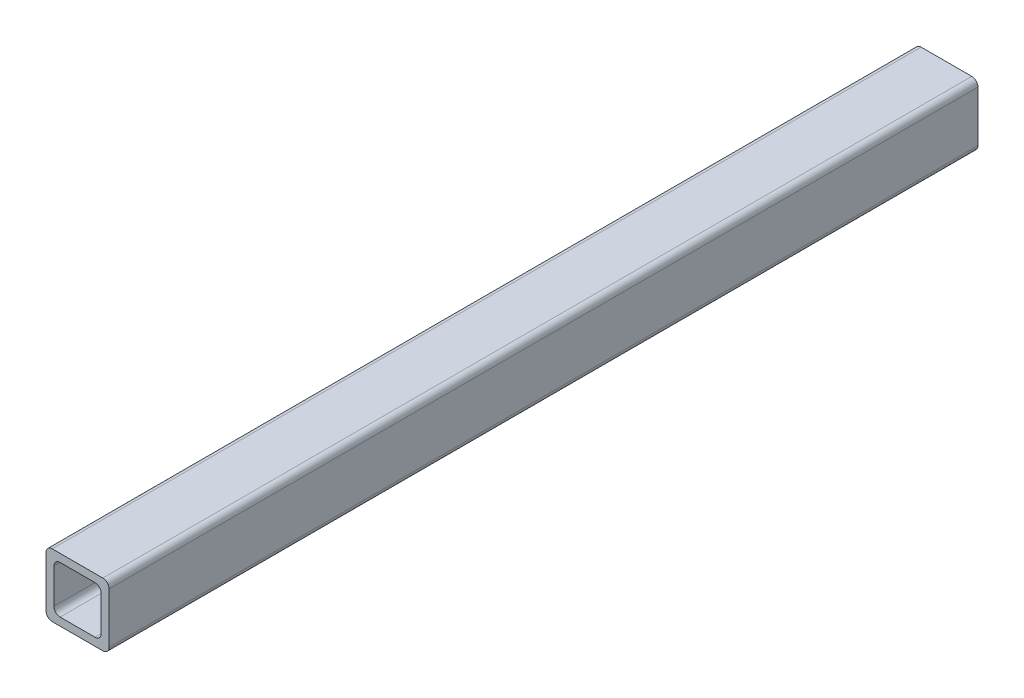
ISO-10303-21;
HEADER;
FILE_DESCRIPTION(('STEP AP214'),'2;1');
FILE_NAME('part.step','',(''),(''),'','','');
FILE_SCHEMA(('AUTOMOTIVE_DESIGN { 1 0 10303 214 1 1 1 1 }'));
ENDSEC;
DATA;
#1=APPLICATION_CONTEXT('core data for automotive mechanical design processes');
#2=APPLICATION_PROTOCOL_DEFINITION('international standard','automotive_design',2000,#1);
#3=PRODUCT_CONTEXT('',#1,'mechanical');
#4=PRODUCT('Part','Part','',(#3));
#5=PRODUCT_RELATED_PRODUCT_CATEGORY('part','',(#4));
#6=PRODUCT_DEFINITION_FORMATION('','',#4);
#7=PRODUCT_DEFINITION_CONTEXT('part definition',#1,'design');
#8=PRODUCT_DEFINITION('design','',#6,#7);
#9=PRODUCT_DEFINITION_SHAPE('','',#8);
#10=(LENGTH_UNIT() NAMED_UNIT(*) SI_UNIT(.MILLI.,.METRE.));
#11=(NAMED_UNIT(*) PLANE_ANGLE_UNIT() SI_UNIT($,.RADIAN.));
#12=(NAMED_UNIT(*) SI_UNIT($,.STERADIAN.) SOLID_ANGLE_UNIT());
#13=UNCERTAINTY_MEASURE_WITH_UNIT(LENGTH_MEASURE(1.E-05),#10,'distance_accuracy_value','');
#14=(GEOMETRIC_REPRESENTATION_CONTEXT(3) GLOBAL_UNCERTAINTY_ASSIGNED_CONTEXT((#13)) GLOBAL_UNIT_ASSIGNED_CONTEXT((#10,
#11,#12)) REPRESENTATION_CONTEXT('',''));
#15=CARTESIAN_POINT('',(0.,0.,0.));
#16=DIRECTION('',(0.,0.,1.));
#17=DIRECTION('',(1.,0.,0.));
#18=AXIS2_PLACEMENT_3D('',#15,#16,#17);
#19=CARTESIAN_POINT('',(10.2,-10.2,350.));
#20=DIRECTION('',(0.,0.,-1.));
#21=DIRECTION('',(-1.,0.,0.));
#22=AXIS2_PLACEMENT_3D('',#19,#20,#21);
#23=PLANE('',#22);
#24=CARTESIAN_POINT('',(10.2,-10.2,350.));
#25=DIRECTION('',(0.,0.,1.));
#26=DIRECTION('',(-1.,0.,0.));
#27=AXIS2_PLACEMENT_3D('',#24,#25,#26);
#28=CIRCLE('',#27,2.5);
#29=CARTESIAN_POINT('',(10.2,-12.7,350.));
#30=VERTEX_POINT('',#29);
#31=CARTESIAN_POINT('',(12.7,-10.2,350.));
#32=VERTEX_POINT('',#31);
#33=EDGE_CURVE('E217',#30,#32,#28,.T.);
#34=ORIENTED_EDGE('',*,*,#33,.T.);
#35=DIRECTION('',(0.,1.,0.));
#36=VECTOR('',#35,1.);
#37=CARTESIAN_POINT('',(12.7,-10.2,350.));
#38=LINE('',#37,#36);
#39=CARTESIAN_POINT('',(12.7,10.2,350.));
#40=VERTEX_POINT('',#39);
#41=EDGE_CURVE('E220',#32,#40,#38,.T.);
#42=ORIENTED_EDGE('',*,*,#41,.T.);
#43=CARTESIAN_POINT('',(10.2,10.2,350.));
#44=DIRECTION('',(0.,0.,1.));
#45=DIRECTION('',(1.,0.,0.));
#46=AXIS2_PLACEMENT_3D('',#43,#44,#45);
#47=CIRCLE('',#46,2.5);
#48=CARTESIAN_POINT('',(10.2,12.7,350.));
#49=VERTEX_POINT('',#48);
#50=EDGE_CURVE('E223',#40,#49,#47,.T.);
#51=ORIENTED_EDGE('',*,*,#50,.T.);
#52=DIRECTION('',(-1.,0.,0.));
#53=VECTOR('',#52,1.);
#54=CARTESIAN_POINT('',(-10.2,12.7,350.));
#55=LINE('',#54,#53);
#56=CARTESIAN_POINT('',(-10.2,12.7,350.));
#57=VERTEX_POINT('',#56);
#58=EDGE_CURVE('E225',#49,#57,#55,.T.);
#59=ORIENTED_EDGE('',*,*,#58,.T.);
#60=CARTESIAN_POINT('',(-10.2,10.2,350.));
#61=DIRECTION('',(0.,0.,1.));
#62=DIRECTION('',(1.,0.,0.));
#63=AXIS2_PLACEMENT_3D('',#60,#61,#62);
#64=CIRCLE('',#63,2.5);
#65=CARTESIAN_POINT('',(-12.7,10.2,350.));
#66=VERTEX_POINT('',#65);
#67=EDGE_CURVE('E227',#57,#66,#64,.T.);
#68=ORIENTED_EDGE('',*,*,#67,.T.);
#69=DIRECTION('',(0.,-1.,0.));
#70=VECTOR('',#69,1.);
#71=CARTESIAN_POINT('',(-12.7,-10.2,350.));
#72=LINE('',#71,#70);
#73=CARTESIAN_POINT('',(-12.7,-10.2,350.));
#74=VERTEX_POINT('',#73);
#75=EDGE_CURVE('E229',#66,#74,#72,.T.);
#76=ORIENTED_EDGE('',*,*,#75,.T.);
#77=CARTESIAN_POINT('',(-10.2,-10.2,350.));
#78=DIRECTION('',(0.,0.,1.));
#79=DIRECTION('',(-1.,0.,0.));
#80=AXIS2_PLACEMENT_3D('',#77,#78,#79);
#81=CIRCLE('',#80,2.5);
#82=CARTESIAN_POINT('',(-10.2,-12.7,350.));
#83=VERTEX_POINT('',#82);
#84=EDGE_CURVE('E231',#74,#83,#81,.T.);
#85=ORIENTED_EDGE('',*,*,#84,.T.);
#86=DIRECTION('',(1.,0.,0.));
#87=VECTOR('',#86,1.);
#88=CARTESIAN_POINT('',(-10.2,-12.7,350.));
#89=LINE('',#88,#87);
#90=EDGE_CURVE('E233',#83,#30,#89,.T.);
#91=ORIENTED_EDGE('',*,*,#90,.T.);
#92=EDGE_LOOP('',(#34,#42,#51,#59,#68,#76,#85,#91));
#93=FACE_BOUND('',#92,.T.);
#94=CARTESIAN_POINT('',(-7.02500000000001,-7.02499999999998,350.));
#95=DIRECTION('',(0.,0.,1.));
#96=DIRECTION('',(-1.,0.,0.));
#97=AXIS2_PLACEMENT_3D('',#94,#95,#96);
#98=CIRCLE('',#97,2.5);
#99=CARTESIAN_POINT('',(-9.52500000000001,-7.02499999999998,350.));
#100=VERTEX_POINT('',#99);
#101=CARTESIAN_POINT('',(-7.02500000000001,-9.52499999999998,350.));
#102=VERTEX_POINT('',#101);
#103=EDGE_CURVE('E152',#100,#102,#98,.T.);
#104=ORIENTED_EDGE('',*,*,#103,.F.);
#105=DIRECTION('',(0.,-1.,0.));
#106=VECTOR('',#105,1.);
#107=CARTESIAN_POINT('',(-9.52500000000001,-7.02499999999998,350.));
#108=LINE('',#107,#106);
#109=CARTESIAN_POINT('',(-9.52500000000001,7.025,350.));
#110=VERTEX_POINT('',#109);
#111=EDGE_CURVE('E185',#110,#100,#108,.T.);
#112=ORIENTED_EDGE('',*,*,#111,.F.);
#113=CARTESIAN_POINT('',(-7.025,7.025,350.));
#114=DIRECTION('',(0.,0.,1.));
#115=DIRECTION('',(-1.,0.,0.));
#116=AXIS2_PLACEMENT_3D('',#113,#114,#115);
#117=CIRCLE('',#116,2.5);
#118=CARTESIAN_POINT('',(-7.025,9.52500000000001,350.));
#119=VERTEX_POINT('',#118);
#120=EDGE_CURVE('E183',#119,#110,#117,.T.);
#121=ORIENTED_EDGE('',*,*,#120,.F.);
#122=DIRECTION('',(-1.,0.,0.));
#123=VECTOR('',#122,1.);
#124=CARTESIAN_POINT('',(-7.025,9.52500000000001,350.));
#125=LINE('',#124,#123);
#126=CARTESIAN_POINT('',(7.02499999999999,9.52500000000001,350.));
#127=VERTEX_POINT('',#126);
#128=EDGE_CURVE('E181',#127,#119,#125,.T.);
#129=ORIENTED_EDGE('',*,*,#128,.F.);
#130=CARTESIAN_POINT('',(7.02499999999999,7.025,350.));
#131=DIRECTION('',(0.,0.,1.));
#132=DIRECTION('',(1.,0.,0.));
#133=AXIS2_PLACEMENT_3D('',#130,#131,#132);
#134=CIRCLE('',#133,2.5);
#135=CARTESIAN_POINT('',(9.52499999999999,7.025,350.));
#136=VERTEX_POINT('',#135);
#137=EDGE_CURVE('E179',#136,#127,#134,.T.);
#138=ORIENTED_EDGE('',*,*,#137,.F.);
#139=DIRECTION('',(0.,1.,0.));
#140=VECTOR('',#139,1.);
#141=CARTESIAN_POINT('',(9.52499999999999,-7.02499999999998,350.));
#142=LINE('',#141,#140);
#143=CARTESIAN_POINT('',(9.52499999999999,-7.02499999999998,350.));
#144=VERTEX_POINT('',#143);
#145=EDGE_CURVE('E175',#144,#136,#142,.T.);
#146=ORIENTED_EDGE('',*,*,#145,.F.);
#147=CARTESIAN_POINT('',(7.02499999999999,-7.02499999999998,350.));
#148=DIRECTION('',(0.,0.,1.));
#149=DIRECTION('',(1.,0.,0.));
#150=AXIS2_PLACEMENT_3D('',#147,#148,#149);
#151=CIRCLE('',#150,2.5);
#152=CARTESIAN_POINT('',(7.02499999999999,-9.52499999999998,350.));
#153=VERTEX_POINT('',#152);
#154=EDGE_CURVE('E173',#153,#144,#151,.T.);
#155=ORIENTED_EDGE('',*,*,#154,.F.);
#156=DIRECTION('',(1.,0.,0.));
#157=VECTOR('',#156,1.);
#158=CARTESIAN_POINT('',(-7.02500000000001,-9.52499999999998,350.));
#159=LINE('',#158,#157);
#160=EDGE_CURVE('E160',#102,#153,#159,.T.);
#161=ORIENTED_EDGE('',*,*,#160,.F.);
#162=EDGE_LOOP('',(#104,#112,#121,#129,#138,#146,#155,#161));
#163=FACE_BOUND('',#162,.T.);
#164=ADVANCED_FACE('F39',(#93,#163),#23,.F.);
#165=CARTESIAN_POINT('',(10.2,-10.2,0.));
#166=DIRECTION('',(0.,0.,-1.));
#167=DIRECTION('',(-1.,0.,0.));
#168=AXIS2_PLACEMENT_3D('',#165,#166,#167);
#169=PLANE('',#168);
#170=CARTESIAN_POINT('',(10.2,-10.2,0.));
#171=DIRECTION('',(0.,0.,1.));
#172=DIRECTION('',(-1.,0.,0.));
#173=AXIS2_PLACEMENT_3D('',#170,#171,#172);
#174=CIRCLE('',#173,2.5);
#175=CARTESIAN_POINT('',(10.2,-12.7,0.));
#176=VERTEX_POINT('',#175);
#177=CARTESIAN_POINT('',(12.7,-10.2,0.));
#178=VERTEX_POINT('',#177);
#179=EDGE_CURVE('E168',#176,#178,#174,.T.);
#180=ORIENTED_EDGE('',*,*,#179,.F.);
#181=DIRECTION('',(1.,0.,0.));
#182=VECTOR('',#181,1.);
#183=CARTESIAN_POINT('',(-10.2,-12.7,0.));
#184=LINE('',#183,#182);
#185=CARTESIAN_POINT('',(-10.2,-12.7,0.));
#186=VERTEX_POINT('',#185);
#187=EDGE_CURVE('E221',#186,#176,#184,.T.);
#188=ORIENTED_EDGE('',*,*,#187,.F.);
#189=CARTESIAN_POINT('',(-10.2,-10.2,0.));
#190=DIRECTION('',(0.,0.,1.));
#191=DIRECTION('',(-1.,0.,0.));
#192=AXIS2_PLACEMENT_3D('',#189,#190,#191);
#193=CIRCLE('',#192,2.5);
#194=CARTESIAN_POINT('',(-12.7,-10.2,0.));
#195=VERTEX_POINT('',#194);
#196=EDGE_CURVE('E248',#195,#186,#193,.T.);
#197=ORIENTED_EDGE('',*,*,#196,.F.);
#198=DIRECTION('',(0.,-1.,0.));
#199=VECTOR('',#198,1.);
#200=CARTESIAN_POINT('',(-12.7,-10.2,0.));
#201=LINE('',#200,#199);
#202=CARTESIAN_POINT('',(-12.7,10.2,0.));
#203=VERTEX_POINT('',#202);
#204=EDGE_CURVE('E246',#203,#195,#201,.T.);
#205=ORIENTED_EDGE('',*,*,#204,.F.);
#206=CARTESIAN_POINT('',(-10.2,10.2,0.));
#207=DIRECTION('',(0.,0.,1.));
#208=DIRECTION('',(1.,0.,0.));
#209=AXIS2_PLACEMENT_3D('',#206,#207,#208);
#210=CIRCLE('',#209,2.5);
#211=CARTESIAN_POINT('',(-10.2,12.7,0.));
#212=VERTEX_POINT('',#211);
#213=EDGE_CURVE('E244',#212,#203,#210,.T.);
#214=ORIENTED_EDGE('',*,*,#213,.F.);
#215=DIRECTION('',(-1.,0.,0.));
#216=VECTOR('',#215,1.);
#217=CARTESIAN_POINT('',(-10.2,12.7,0.));
#218=LINE('',#217,#216);
#219=CARTESIAN_POINT('',(10.2,12.7,0.));
#220=VERTEX_POINT('',#219);
#221=EDGE_CURVE('E242',#220,#212,#218,.T.);
#222=ORIENTED_EDGE('',*,*,#221,.F.);
#223=CARTESIAN_POINT('',(10.2,10.2,0.));
#224=DIRECTION('',(0.,0.,1.));
#225=DIRECTION('',(1.,0.,0.));
#226=AXIS2_PLACEMENT_3D('',#223,#224,#225);
#227=CIRCLE('',#226,2.5);
#228=CARTESIAN_POINT('',(12.7,10.2,0.));
#229=VERTEX_POINT('',#228);
#230=EDGE_CURVE('E240',#229,#220,#227,.T.);
#231=ORIENTED_EDGE('',*,*,#230,.F.);
#232=DIRECTION('',(0.,1.,0.));
#233=VECTOR('',#232,1.);
#234=CARTESIAN_POINT('',(12.7,-10.2,0.));
#235=LINE('',#234,#233);
#236=EDGE_CURVE('E238',#178,#229,#235,.T.);
#237=ORIENTED_EDGE('',*,*,#236,.F.);
#238=EDGE_LOOP('',(#180,#188,#197,#205,#214,#222,#231,#237));
#239=FACE_BOUND('',#238,.T.);
#240=DIRECTION('',(0.,-1.,0.));
#241=VECTOR('',#240,1.);
#242=CARTESIAN_POINT('',(-9.52500000000001,-7.02499999999998,0.));
#243=LINE('',#242,#241);
#244=CARTESIAN_POINT('',(-9.52500000000001,7.02500000000001,0.));
#245=VERTEX_POINT('',#244);
#246=CARTESIAN_POINT('',(-9.52500000000001,-7.02499999999998,0.));
#247=VERTEX_POINT('',#246);
#248=EDGE_CURVE('E161',#245,#247,#243,.T.);
#249=ORIENTED_EDGE('',*,*,#248,.T.);
#250=CARTESIAN_POINT('',(-7.02500000000001,-7.02499999999998,0.));
#251=DIRECTION('',(0.,0.,1.));
#252=DIRECTION('',(-1.,0.,0.));
#253=AXIS2_PLACEMENT_3D('',#250,#251,#252);
#254=CIRCLE('',#253,2.5);
#255=CARTESIAN_POINT('',(-7.02500000000001,-9.52499999999998,0.));
#256=VERTEX_POINT('',#255);
#257=EDGE_CURVE('E62',#247,#256,#254,.T.);
#258=ORIENTED_EDGE('',*,*,#257,.T.);
#259=DIRECTION('',(1.,0.,0.));
#260=VECTOR('',#259,1.);
#261=CARTESIAN_POINT('',(-7.02500000000001,-9.52499999999998,0.));
#262=LINE('',#261,#260);
#263=CARTESIAN_POINT('',(7.02499999999999,-9.52499999999998,0.));
#264=VERTEX_POINT('',#263);
#265=EDGE_CURVE('E167',#256,#264,#262,.T.);
#266=ORIENTED_EDGE('',*,*,#265,.T.);
#267=CARTESIAN_POINT('',(7.02499999999999,-7.02499999999998,0.));
#268=DIRECTION('',(0.,0.,1.));
#269=DIRECTION('',(1.,0.,0.));
#270=AXIS2_PLACEMENT_3D('',#267,#268,#269);
#271=CIRCLE('',#270,2.5);
#272=CARTESIAN_POINT('',(9.52499999999999,-7.02499999999998,0.));
#273=VERTEX_POINT('',#272);
#274=EDGE_CURVE('E189',#264,#273,#271,.T.);
#275=ORIENTED_EDGE('',*,*,#274,.T.);
#276=DIRECTION('',(0.,1.,0.));
#277=VECTOR('',#276,1.);
#278=CARTESIAN_POINT('',(9.52499999999999,-7.02499999999998,0.));
#279=LINE('',#278,#277);
#280=CARTESIAN_POINT('',(9.52499999999999,7.025,0.));
#281=VERTEX_POINT('',#280);
#282=EDGE_CURVE('E192',#273,#281,#279,.T.);
#283=ORIENTED_EDGE('',*,*,#282,.T.);
#284=CARTESIAN_POINT('',(7.02499999999999,7.025,0.));
#285=DIRECTION('',(0.,0.,1.));
#286=DIRECTION('',(1.,0.,0.));
#287=AXIS2_PLACEMENT_3D('',#284,#285,#286);
#288=CIRCLE('',#287,2.5);
#289=CARTESIAN_POINT('',(7.02499999999999,9.52500000000001,0.));
#290=VERTEX_POINT('',#289);
#291=EDGE_CURVE('E195',#281,#290,#288,.T.);
#292=ORIENTED_EDGE('',*,*,#291,.T.);
#293=DIRECTION('',(-1.,0.,0.));
#294=VECTOR('',#293,1.);
#295=CARTESIAN_POINT('',(-7.025,9.52500000000001,0.));
#296=LINE('',#295,#294);
#297=CARTESIAN_POINT('',(-7.025,9.52500000000001,0.));
#298=VERTEX_POINT('',#297);
#299=EDGE_CURVE('E198',#290,#298,#296,.T.);
#300=ORIENTED_EDGE('',*,*,#299,.T.);
#301=CARTESIAN_POINT('',(-7.025,7.025,0.));
#302=DIRECTION('',(0.,0.,1.));
#303=DIRECTION('',(-1.,0.,0.));
#304=AXIS2_PLACEMENT_3D('',#301,#302,#303);
#305=CIRCLE('',#304,2.5);
#306=EDGE_CURVE('E201',#298,#245,#305,.T.);
#307=ORIENTED_EDGE('',*,*,#306,.T.);
#308=EDGE_LOOP('',(#249,#258,#266,#275,#283,#292,#300,#307));
#309=FACE_BOUND('',#308,.T.);
#310=ADVANCED_FACE('F278',(#239,#309),#169,.T.);
#311=CARTESIAN_POINT('',(10.2,-10.2,350.));
#312=DIRECTION('',(0.,0.,-1.));
#313=DIRECTION('',(-1.,0.,0.));
#314=AXIS2_PLACEMENT_3D('',#311,#312,#313);
#315=CYLINDRICAL_SURFACE('',#314,2.5);
#316=ORIENTED_EDGE('',*,*,#179,.T.);
#317=DIRECTION('',(0.,0.,-1.));
#318=VECTOR('',#317,1.);
#319=CARTESIAN_POINT('',(12.7,-10.2,350.));
#320=LINE('',#319,#318);
#321=EDGE_CURVE('E11',#32,#178,#320,.T.);
#322=ORIENTED_EDGE('',*,*,#321,.F.);
#323=ORIENTED_EDGE('',*,*,#33,.F.);
#324=DIRECTION('',(0.,0.,-1.));
#325=VECTOR('',#324,1.);
#326=CARTESIAN_POINT('',(10.2,-12.7,350.));
#327=LINE('',#326,#325);
#328=EDGE_CURVE('E235',#30,#176,#327,.T.);
#329=ORIENTED_EDGE('',*,*,#328,.T.);
#330=EDGE_LOOP('',(#316,#322,#323,#329));
#331=FACE_BOUND('',#330,.T.);
#332=ADVANCED_FACE('F41',(#331),#315,.T.);
#333=CARTESIAN_POINT('',(12.7,-10.2,350.));
#334=DIRECTION('',(-1.,0.,0.));
#335=DIRECTION('',(0.,-1.,0.));
#336=AXIS2_PLACEMENT_3D('',#333,#334,#335);
#337=PLANE('',#336);
#338=ORIENTED_EDGE('',*,*,#236,.T.);
#339=DIRECTION('',(0.,0.,-1.));
#340=VECTOR('',#339,1.);
#341=CARTESIAN_POINT('',(12.7,10.2,350.));
#342=LINE('',#341,#340);
#343=EDGE_CURVE('E47',#40,#229,#342,.T.);
#344=ORIENTED_EDGE('',*,*,#343,.F.);
#345=ORIENTED_EDGE('',*,*,#41,.F.);
#346=ORIENTED_EDGE('',*,*,#321,.T.);
#347=EDGE_LOOP('',(#338,#344,#345,#346));
#348=FACE_BOUND('',#347,.T.);
#349=ADVANCED_FACE('F295',(#348),#337,.F.);
#350=CARTESIAN_POINT('',(10.2,10.2,350.));
#351=DIRECTION('',(0.,0.,-1.));
#352=DIRECTION('',(-1.,0.,0.));
#353=AXIS2_PLACEMENT_3D('',#350,#351,#352);
#354=CYLINDRICAL_SURFACE('',#353,2.5);
#355=ORIENTED_EDGE('',*,*,#230,.T.);
#356=DIRECTION('',(0.,0.,-1.));
#357=VECTOR('',#356,1.);
#358=CARTESIAN_POINT('',(10.2,12.7,350.));
#359=LINE('',#358,#357);
#360=EDGE_CURVE('E265',#49,#220,#359,.T.);
#361=ORIENTED_EDGE('',*,*,#360,.F.);
#362=ORIENTED_EDGE('',*,*,#50,.F.);
#363=ORIENTED_EDGE('',*,*,#343,.T.);
#364=EDGE_LOOP('',(#355,#361,#362,#363));
#365=FACE_BOUND('',#364,.T.);
#366=ADVANCED_FACE('F272',(#365),#354,.T.);
#367=CARTESIAN_POINT('',(-10.2,12.7,350.));
#368=DIRECTION('',(0.,-1.,0.));
#369=DIRECTION('',(1.,0.,0.));
#370=AXIS2_PLACEMENT_3D('',#367,#368,#369);
#371=PLANE('',#370);
#372=ORIENTED_EDGE('',*,*,#221,.T.);
#373=DIRECTION('',(0.,0.,-1.));
#374=VECTOR('',#373,1.);
#375=CARTESIAN_POINT('',(-10.2,12.7,350.));
#376=LINE('',#375,#374);
#377=EDGE_CURVE('E262',#57,#212,#376,.T.);
#378=ORIENTED_EDGE('',*,*,#377,.F.);
#379=ORIENTED_EDGE('',*,*,#58,.F.);
#380=ORIENTED_EDGE('',*,*,#360,.T.);
#381=EDGE_LOOP('',(#372,#378,#379,#380));
#382=FACE_BOUND('',#381,.T.);
#383=ADVANCED_FACE('F284',(#382),#371,.F.);
#384=CARTESIAN_POINT('',(-10.2,10.2,350.));
#385=DIRECTION('',(0.,0.,-1.));
#386=DIRECTION('',(-1.,0.,0.));
#387=AXIS2_PLACEMENT_3D('',#384,#385,#386);
#388=CYLINDRICAL_SURFACE('',#387,2.5);
#389=ORIENTED_EDGE('',*,*,#213,.T.);
#390=DIRECTION('',(0.,0.,-1.));
#391=VECTOR('',#390,1.);
#392=CARTESIAN_POINT('',(-12.7,10.2,350.));
#393=LINE('',#392,#391);
#394=EDGE_CURVE('E259',#66,#203,#393,.T.);
#395=ORIENTED_EDGE('',*,*,#394,.F.);
#396=ORIENTED_EDGE('',*,*,#67,.F.);
#397=ORIENTED_EDGE('',*,*,#377,.T.);
#398=EDGE_LOOP('',(#389,#395,#396,#397));
#399=FACE_BOUND('',#398,.T.);
#400=ADVANCED_FACE('F288',(#399),#388,.T.);
#401=CARTESIAN_POINT('',(-12.7,-10.2,350.));
#402=DIRECTION('',(1.,0.,0.));
#403=DIRECTION('',(0.,0.,-1.));
#404=AXIS2_PLACEMENT_3D('',#401,#402,#403);
#405=PLANE('',#404);
#406=ORIENTED_EDGE('',*,*,#204,.T.);
#407=DIRECTION('',(0.,0.,-1.));
#408=VECTOR('',#407,1.);
#409=CARTESIAN_POINT('',(-12.7,-10.2,350.));
#410=LINE('',#409,#408);
#411=EDGE_CURVE('E256',#74,#195,#410,.T.);
#412=ORIENTED_EDGE('',*,*,#411,.F.);
#413=ORIENTED_EDGE('',*,*,#75,.F.);
#414=ORIENTED_EDGE('',*,*,#394,.T.);
#415=EDGE_LOOP('',(#406,#412,#413,#414));
#416=FACE_BOUND('',#415,.T.);
#417=ADVANCED_FACE('F308',(#416),#405,.F.);
#418=CARTESIAN_POINT('',(-10.2,-10.2,350.));
#419=DIRECTION('',(0.,0.,-1.));
#420=DIRECTION('',(-1.,0.,0.));
#421=AXIS2_PLACEMENT_3D('',#418,#419,#420);
#422=CYLINDRICAL_SURFACE('',#421,2.5);
#423=ORIENTED_EDGE('',*,*,#196,.T.);
#424=DIRECTION('',(0.,0.,-1.));
#425=VECTOR('',#424,1.);
#426=CARTESIAN_POINT('',(-10.2,-12.7,350.));
#427=LINE('',#426,#425);
#428=EDGE_CURVE('E253',#83,#186,#427,.T.);
#429=ORIENTED_EDGE('',*,*,#428,.F.);
#430=ORIENTED_EDGE('',*,*,#84,.F.);
#431=ORIENTED_EDGE('',*,*,#411,.T.);
#432=EDGE_LOOP('',(#423,#429,#430,#431));
#433=FACE_BOUND('',#432,.T.);
#434=ADVANCED_FACE('F306',(#433),#422,.T.);
#435=CARTESIAN_POINT('',(-10.2,-12.7,350.));
#436=DIRECTION('',(0.,1.,0.));
#437=DIRECTION('',(0.,0.,1.));
#438=AXIS2_PLACEMENT_3D('',#435,#436,#437);
#439=PLANE('',#438);
#440=ORIENTED_EDGE('',*,*,#187,.T.);
#441=ORIENTED_EDGE('',*,*,#328,.F.);
#442=ORIENTED_EDGE('',*,*,#90,.F.);
#443=ORIENTED_EDGE('',*,*,#428,.T.);
#444=EDGE_LOOP('',(#440,#441,#442,#443));
#445=FACE_BOUND('',#444,.T.);
#446=ADVANCED_FACE('F301',(#445),#439,.F.);
#447=CARTESIAN_POINT('',(-7.02500000000001,-7.02499999999998,350.));
#448=DIRECTION('',(0.,0.,-1.));
#449=DIRECTION('',(-1.,0.,0.));
#450=AXIS2_PLACEMENT_3D('',#447,#448,#449);
#451=CYLINDRICAL_SURFACE('',#450,2.5);
#452=ORIENTED_EDGE('',*,*,#257,.F.);
#453=DIRECTION('',(0.,0.,-1.));
#454=VECTOR('',#453,1.);
#455=CARTESIAN_POINT('',(-9.52500000000001,-7.02499999999998,350.));
#456=LINE('',#455,#454);
#457=EDGE_CURVE('E156',#100,#247,#456,.T.);
#458=ORIENTED_EDGE('',*,*,#457,.F.);
#459=ORIENTED_EDGE('',*,*,#103,.T.);
#460=DIRECTION('',(0.,0.,-1.));
#461=VECTOR('',#460,1.);
#462=CARTESIAN_POINT('',(-7.02500000000001,-9.52499999999998,350.));
#463=LINE('',#462,#461);
#464=EDGE_CURVE('E155',#102,#256,#463,.T.);
#465=ORIENTED_EDGE('',*,*,#464,.T.);
#466=EDGE_LOOP('',(#452,#458,#459,#465));
#467=FACE_BOUND('',#466,.T.);
#468=ADVANCED_FACE('F154',(#467),#451,.F.);
#469=CARTESIAN_POINT('',(-7.02500000000001,-9.52499999999998,350.));
#470=DIRECTION('',(0.,1.,0.));
#471=DIRECTION('',(0.,0.,1.));
#472=AXIS2_PLACEMENT_3D('',#469,#470,#471);
#473=PLANE('',#472);
#474=ORIENTED_EDGE('',*,*,#265,.F.);
#475=ORIENTED_EDGE('',*,*,#464,.F.);
#476=ORIENTED_EDGE('',*,*,#160,.T.);
#477=DIRECTION('',(0.,0.,-1.));
#478=VECTOR('',#477,1.);
#479=CARTESIAN_POINT('',(7.02499999999999,-9.52499999999998,350.));
#480=LINE('',#479,#478);
#481=EDGE_CURVE('E169',#153,#264,#480,.T.);
#482=ORIENTED_EDGE('',*,*,#481,.T.);
#483=EDGE_LOOP('',(#474,#475,#476,#482));
#484=FACE_BOUND('',#483,.T.);
#485=ADVANCED_FACE('F164',(#484),#473,.T.);
#486=CARTESIAN_POINT('',(7.02499999999999,-7.02499999999998,350.));
#487=DIRECTION('',(0.,0.,-1.));
#488=DIRECTION('',(-1.,0.,0.));
#489=AXIS2_PLACEMENT_3D('',#486,#487,#488);
#490=CYLINDRICAL_SURFACE('',#489,2.5);
#491=ORIENTED_EDGE('',*,*,#274,.F.);
#492=ORIENTED_EDGE('',*,*,#481,.F.);
#493=ORIENTED_EDGE('',*,*,#154,.T.);
#494=DIRECTION('',(0.,0.,-1.));
#495=VECTOR('',#494,1.);
#496=CARTESIAN_POINT('',(9.52499999999999,-7.02499999999998,350.));
#497=LINE('',#496,#495);
#498=EDGE_CURVE('E214',#144,#273,#497,.T.);
#499=ORIENTED_EDGE('',*,*,#498,.T.);
#500=EDGE_LOOP('',(#491,#492,#493,#499));
#501=FACE_BOUND('',#500,.T.);
#502=ADVANCED_FACE('F333',(#501),#490,.F.);
#503=CARTESIAN_POINT('',(9.52499999999999,-7.02499999999998,350.));
#504=DIRECTION('',(-1.,0.,0.));
#505=DIRECTION('',(0.,-1.,0.));
#506=AXIS2_PLACEMENT_3D('',#503,#504,#505);
#507=PLANE('',#506);
#508=ORIENTED_EDGE('',*,*,#282,.F.);
#509=ORIENTED_EDGE('',*,*,#498,.F.);
#510=ORIENTED_EDGE('',*,*,#145,.T.);
#511=DIRECTION('',(0.,0.,-1.));
#512=VECTOR('',#511,1.);
#513=CARTESIAN_POINT('',(9.52499999999999,7.025,350.));
#514=LINE('',#513,#512);
#515=EDGE_CURVE('E212',#136,#281,#514,.T.);
#516=ORIENTED_EDGE('',*,*,#515,.T.);
#517=EDGE_LOOP('',(#508,#509,#510,#516));
#518=FACE_BOUND('',#517,.T.);
#519=ADVANCED_FACE('F337',(#518),#507,.T.);
#520=CARTESIAN_POINT('',(7.02499999999999,7.025,350.));
#521=DIRECTION('',(0.,0.,-1.));
#522=DIRECTION('',(-1.,0.,0.));
#523=AXIS2_PLACEMENT_3D('',#520,#521,#522);
#524=CYLINDRICAL_SURFACE('',#523,2.5);
#525=ORIENTED_EDGE('',*,*,#291,.F.);
#526=ORIENTED_EDGE('',*,*,#515,.F.);
#527=ORIENTED_EDGE('',*,*,#137,.T.);
#528=DIRECTION('',(0.,0.,-1.));
#529=VECTOR('',#528,1.);
#530=CARTESIAN_POINT('',(7.02499999999999,9.52500000000001,350.));
#531=LINE('',#530,#529);
#532=EDGE_CURVE('E210',#127,#290,#531,.T.);
#533=ORIENTED_EDGE('',*,*,#532,.T.);
#534=EDGE_LOOP('',(#525,#526,#527,#533));
#535=FACE_BOUND('',#534,.T.);
#536=ADVANCED_FACE('F343',(#535),#524,.F.);
#537=CARTESIAN_POINT('',(-7.025,9.52500000000001,350.));
#538=DIRECTION('',(0.,-1.,0.));
#539=DIRECTION('',(0.,0.,-1.));
#540=AXIS2_PLACEMENT_3D('',#537,#538,#539);
#541=PLANE('',#540);
#542=ORIENTED_EDGE('',*,*,#299,.F.);
#543=ORIENTED_EDGE('',*,*,#532,.F.);
#544=ORIENTED_EDGE('',*,*,#128,.T.);
#545=DIRECTION('',(0.,0.,-1.));
#546=VECTOR('',#545,1.);
#547=CARTESIAN_POINT('',(-7.025,9.52500000000001,350.));
#548=LINE('',#547,#546);
#549=EDGE_CURVE('E208',#119,#298,#548,.T.);
#550=ORIENTED_EDGE('',*,*,#549,.T.);
#551=EDGE_LOOP('',(#542,#543,#544,#550));
#552=FACE_BOUND('',#551,.T.);
#553=ADVANCED_FACE('F347',(#552),#541,.T.);
#554=CARTESIAN_POINT('',(-7.025,7.025,350.));
#555=DIRECTION('',(0.,0.,-1.));
#556=DIRECTION('',(-1.,0.,0.));
#557=AXIS2_PLACEMENT_3D('',#554,#555,#556);
#558=CYLINDRICAL_SURFACE('',#557,2.5);
#559=ORIENTED_EDGE('',*,*,#306,.F.);
#560=ORIENTED_EDGE('',*,*,#549,.F.);
#561=ORIENTED_EDGE('',*,*,#120,.T.);
#562=DIRECTION('',(0.,0.,-1.));
#563=VECTOR('',#562,1.);
#564=CARTESIAN_POINT('',(-9.52500000000001,7.02500000000001,350.));
#565=LINE('',#564,#563);
#566=EDGE_CURVE('E54',#110,#245,#565,.T.);
#567=ORIENTED_EDGE('',*,*,#566,.T.);
#568=EDGE_LOOP('',(#559,#560,#561,#567));
#569=FACE_BOUND('',#568,.T.);
#570=ADVANCED_FACE('F351',(#569),#558,.F.);
#571=CARTESIAN_POINT('',(-9.52500000000001,-7.02499999999998,350.));
#572=DIRECTION('',(1.,0.,0.));
#573=DIRECTION('',(0.,0.,-1.));
#574=AXIS2_PLACEMENT_3D('',#571,#572,#573);
#575=PLANE('',#574);
#576=ORIENTED_EDGE('',*,*,#248,.F.);
#577=ORIENTED_EDGE('',*,*,#566,.F.);
#578=ORIENTED_EDGE('',*,*,#111,.T.);
#579=ORIENTED_EDGE('',*,*,#457,.T.);
#580=EDGE_LOOP('',(#576,#577,#578,#579));
#581=FACE_BOUND('',#580,.T.);
#582=ADVANCED_FACE('F355',(#581),#575,.T.);
#583=CLOSED_SHELL('',(#164,#310,#332,#349,#366,#383,#400,#417,#434,#446,#468,#485,#502,#519,
#536,#553,#570,#582));
#584=MANIFOLD_SOLID_BREP('B2',#583);
#585=ADVANCED_BREP_SHAPE_REPRESENTATION('',(#18,#584),#14);
#586=SHAPE_DEFINITION_REPRESENTATION(#9,#585);
ENDSEC;
END-ISO-10303-21;
